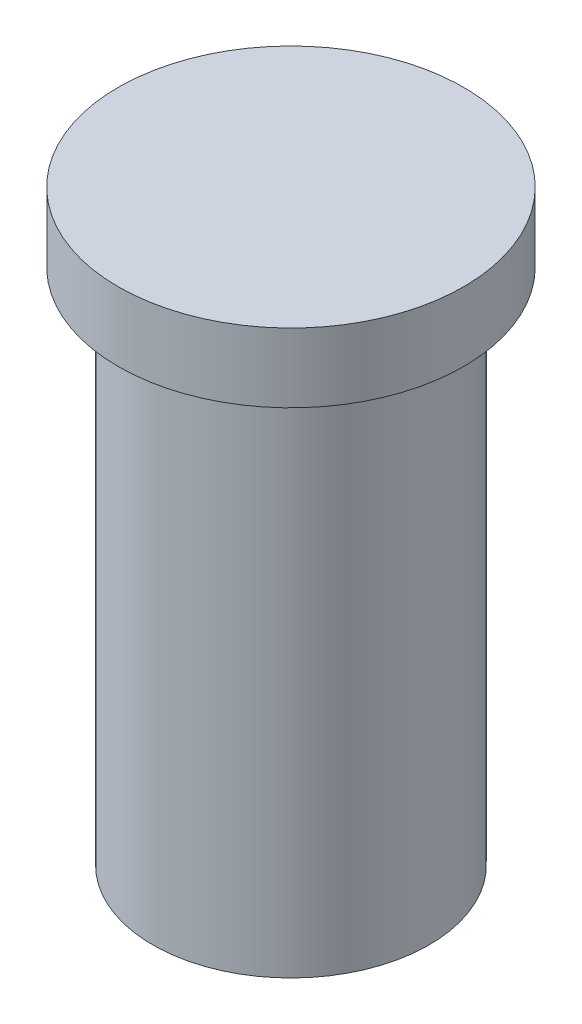
ISO-10303-21;
HEADER;
FILE_DESCRIPTION(('STEP AP214'),'2;1');
FILE_NAME('part.step','',(''),(''),'','','');
FILE_SCHEMA(('AUTOMOTIVE_DESIGN { 1 0 10303 214 1 1 1 1 }'));
ENDSEC;
DATA;
#1=APPLICATION_CONTEXT('core data for automotive mechanical design processes');
#2=APPLICATION_PROTOCOL_DEFINITION('international standard','automotive_design',2000,#1);
#3=PRODUCT_CONTEXT('',#1,'mechanical');
#4=PRODUCT('Part','Part','',(#3));
#5=PRODUCT_RELATED_PRODUCT_CATEGORY('part','',(#4));
#6=PRODUCT_DEFINITION_FORMATION('','',#4);
#7=PRODUCT_DEFINITION_CONTEXT('part definition',#1,'design');
#8=PRODUCT_DEFINITION('design','',#6,#7);
#9=PRODUCT_DEFINITION_SHAPE('','',#8);
#10=(LENGTH_UNIT() NAMED_UNIT(*) SI_UNIT(.MILLI.,.METRE.));
#11=(NAMED_UNIT(*) PLANE_ANGLE_UNIT() SI_UNIT($,.RADIAN.));
#12=(NAMED_UNIT(*) SI_UNIT($,.STERADIAN.) SOLID_ANGLE_UNIT());
#13=UNCERTAINTY_MEASURE_WITH_UNIT(LENGTH_MEASURE(1.E-05),#10,'distance_accuracy_value','');
#14=(GEOMETRIC_REPRESENTATION_CONTEXT(3) GLOBAL_UNCERTAINTY_ASSIGNED_CONTEXT((#13)) GLOBAL_UNIT_ASSIGNED_CONTEXT((#10,
#11,#12)) REPRESENTATION_CONTEXT('',''));
#15=CARTESIAN_POINT('',(0.,0.,0.));
#16=DIRECTION('',(0.,0.,1.));
#17=DIRECTION('',(1.,0.,0.));
#18=AXIS2_PLACEMENT_3D('',#15,#16,#17);
#19=CARTESIAN_POINT('',(0.,2.,0.));
#20=DIRECTION('',(0.,-1.,0.));
#21=DIRECTION('',(0.,0.,-1.));
#22=AXIS2_PLACEMENT_3D('',#19,#20,#21);
#23=CYLINDRICAL_SURFACE('',#22,5.);
#24=CARTESIAN_POINT('',(0.,2.,0.));
#25=DIRECTION('',(0.,1.,0.));
#26=DIRECTION('',(0.,0.,1.));
#27=AXIS2_PLACEMENT_3D('',#24,#25,#26);
#28=CIRCLE('',#27,5.);
#29=CARTESIAN_POINT('',(0.,2.,5.));
#30=VERTEX_POINT('',#29);
#31=EDGE_CURVE('E45',#30,#30,#28,.T.);
#32=ORIENTED_EDGE('',*,*,#31,.F.);
#33=EDGE_LOOP('',(#32));
#34=FACE_BOUND('',#33,.T.);
#35=CARTESIAN_POINT('',(0.,0.,0.));
#36=DIRECTION('',(0.,1.,0.));
#37=DIRECTION('',(0.,0.,1.));
#38=AXIS2_PLACEMENT_3D('',#35,#36,#37);
#39=CIRCLE('',#38,5.);
#40=CARTESIAN_POINT('',(0.,0.,5.));
#41=VERTEX_POINT('',#40);
#42=EDGE_CURVE('E40',#41,#41,#39,.T.);
#43=ORIENTED_EDGE('',*,*,#42,.T.);
#44=EDGE_LOOP('',(#43));
#45=FACE_BOUND('',#44,.T.);
#46=ADVANCED_FACE('F37',(#34,#45),#23,.T.);
#47=CARTESIAN_POINT('',(0.,2.,0.));
#48=DIRECTION('',(0.,1.,0.));
#49=DIRECTION('',(0.,0.,1.));
#50=AXIS2_PLACEMENT_3D('',#47,#48,#49);
#51=PLANE('',#50);
#52=ORIENTED_EDGE('',*,*,#31,.T.);
#53=EDGE_LOOP('',(#52));
#54=FACE_BOUND('',#53,.T.);
#55=ADVANCED_FACE('F65',(#54),#51,.T.);
#56=CARTESIAN_POINT('',(0.,0.,0.));
#57=DIRECTION('',(0.,1.,0.));
#58=DIRECTION('',(0.,0.,1.));
#59=AXIS2_PLACEMENT_3D('',#56,#57,#58);
#60=PLANE('',#59);
#61=CARTESIAN_POINT('',(0.,0.,0.));
#62=DIRECTION('',(0.,-1.,0.));
#63=DIRECTION('',(0.,0.,-1.));
#64=AXIS2_PLACEMENT_3D('',#61,#62,#63);
#65=CIRCLE('',#64,4.);
#66=CARTESIAN_POINT('',(0.,0.,-4.));
#67=VERTEX_POINT('',#66);
#68=EDGE_CURVE('E10',#67,#67,#65,.T.);
#69=ORIENTED_EDGE('',*,*,#68,.F.);
#70=EDGE_LOOP('',(#69));
#71=FACE_BOUND('',#70,.T.);
#72=ORIENTED_EDGE('',*,*,#42,.F.);
#73=EDGE_LOOP('',(#72));
#74=FACE_BOUND('',#73,.T.);
#75=ADVANCED_FACE('F62',(#71,#74),#60,.F.);
#76=CARTESIAN_POINT('',(0.,-15.,0.));
#77=DIRECTION('',(0.,1.,0.));
#78=DIRECTION('',(0.,0.,1.));
#79=AXIS2_PLACEMENT_3D('',#76,#77,#78);
#80=CYLINDRICAL_SURFACE('',#79,4.);
#81=CARTESIAN_POINT('',(0.,-15.,0.));
#82=DIRECTION('',(0.,-1.,0.));
#83=DIRECTION('',(0.,0.,-1.));
#84=AXIS2_PLACEMENT_3D('',#81,#82,#83);
#85=CIRCLE('',#84,4.);
#86=CARTESIAN_POINT('',(0.,-15.,-4.));
#87=VERTEX_POINT('',#86);
#88=EDGE_CURVE('E52',#87,#87,#85,.T.);
#89=ORIENTED_EDGE('',*,*,#88,.F.);
#90=EDGE_LOOP('',(#89));
#91=FACE_BOUND('',#90,.T.);
#92=ORIENTED_EDGE('',*,*,#68,.T.);
#93=EDGE_LOOP('',(#92));
#94=FACE_BOUND('',#93,.T.);
#95=ADVANCED_FACE('F64',(#91,#94),#80,.T.);
#96=CARTESIAN_POINT('',(0.,-15.,0.));
#97=DIRECTION('',(0.,-1.,0.));
#98=DIRECTION('',(0.,0.,-1.));
#99=AXIS2_PLACEMENT_3D('',#96,#97,#98);
#100=PLANE('',#99);
#101=ORIENTED_EDGE('',*,*,#88,.T.);
#102=EDGE_LOOP('',(#101));
#103=FACE_BOUND('',#102,.T.);
#104=ADVANCED_FACE('F71',(#103),#100,.T.);
#105=CLOSED_SHELL('',(#46,#55,#75,#95,#104));
#106=MANIFOLD_SOLID_BREP('B2',#105);
#107=ADVANCED_BREP_SHAPE_REPRESENTATION('',(#18,#106),#14);
#108=SHAPE_DEFINITION_REPRESENTATION(#9,#107);
ENDSEC;
END-ISO-10303-21;
